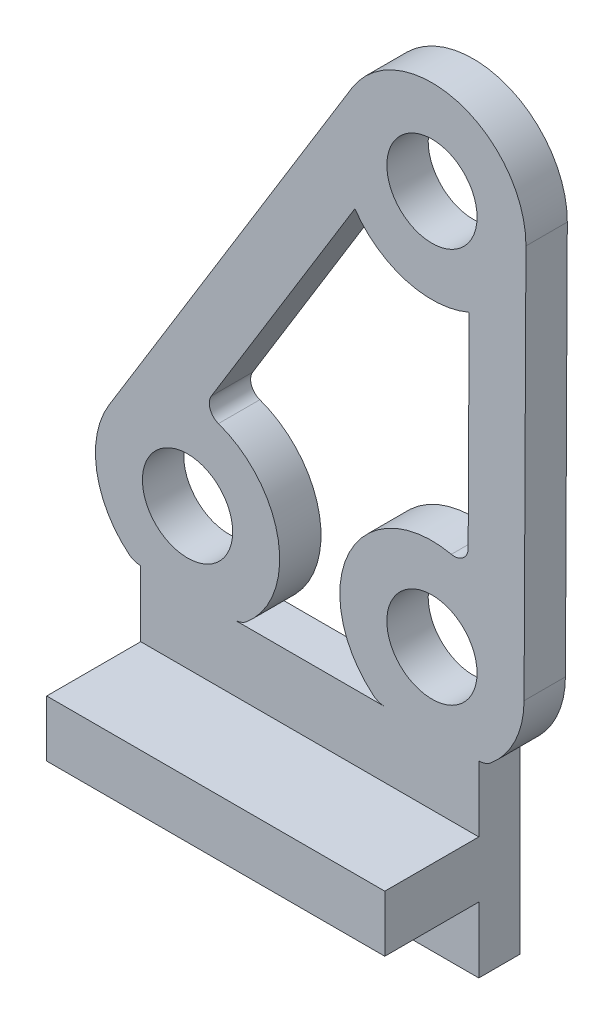
ISO-10303-21;
HEADER;
FILE_DESCRIPTION(('STEP AP214'),'2;1');
FILE_NAME('part.step','',(''),(''),'','','');
FILE_SCHEMA(('AUTOMOTIVE_DESIGN { 1 0 10303 214 1 1 1 1 }'));
ENDSEC;
DATA;
#1=APPLICATION_CONTEXT('core data for automotive mechanical design processes');
#2=APPLICATION_PROTOCOL_DEFINITION('international standard','automotive_design',2000,#1);
#3=PRODUCT_CONTEXT('',#1,'mechanical');
#4=PRODUCT('Part','Part','',(#3));
#5=PRODUCT_RELATED_PRODUCT_CATEGORY('part','',(#4));
#6=PRODUCT_DEFINITION_FORMATION('','',#4);
#7=PRODUCT_DEFINITION_CONTEXT('part definition',#1,'design');
#8=PRODUCT_DEFINITION('design','',#6,#7);
#9=PRODUCT_DEFINITION_SHAPE('','',#8);
#10=(LENGTH_UNIT() NAMED_UNIT(*) SI_UNIT(.MILLI.,.METRE.));
#11=(NAMED_UNIT(*) PLANE_ANGLE_UNIT() SI_UNIT($,.RADIAN.));
#12=(NAMED_UNIT(*) SI_UNIT($,.STERADIAN.) SOLID_ANGLE_UNIT());
#13=UNCERTAINTY_MEASURE_WITH_UNIT(LENGTH_MEASURE(1.E-05),#10,'distance_accuracy_value','');
#14=(GEOMETRIC_REPRESENTATION_CONTEXT(3) GLOBAL_UNCERTAINTY_ASSIGNED_CONTEXT((#13)) GLOBAL_UNIT_ASSIGNED_CONTEXT((#10,
#11,#12)) REPRESENTATION_CONTEXT('',''));
#15=CARTESIAN_POINT('',(0.,0.,0.));
#16=DIRECTION('',(0.,0.,1.));
#17=DIRECTION('',(1.,0.,0.));
#18=AXIS2_PLACEMENT_3D('',#15,#16,#17);
#19=CARTESIAN_POINT('',(0.,0.,8.));
#20=DIRECTION('',(0.,0.,1.));
#21=DIRECTION('',(1.,0.,0.));
#22=AXIS2_PLACEMENT_3D('',#19,#20,#21);
#23=PLANE('',#22);
#24=DIRECTION('',(-1.,0.,0.));
#25=VECTOR('',#24,1.);
#26=CARTESIAN_POINT('',(-1.24599357943771,-2.,8.));
#27=LINE('',#26,#25);
#28=CARTESIAN_POINT('',(5.25400642056229,-2.,8.));
#29=VERTEX_POINT('',#28);
#30=CARTESIAN_POINT('',(1.24599357943771,-2.,8.));
#31=VERTEX_POINT('',#30);
#32=EDGE_CURVE('E47',#29,#31,#27,.T.);
#33=ORIENTED_EDGE('',*,*,#32,.T.);
#34=CARTESIAN_POINT('',(1.24599357943771,-1.5,8.));
#35=DIRECTION('',(0.,0.,1.));
#36=DIRECTION('',(1.,0.,0.));
#37=AXIS2_PLACEMENT_3D('',#34,#35,#36);
#38=CIRCLE('',#37,0.500000000000002);
#39=CARTESIAN_POINT('',(1.56547911262687,-1.88461538461538,8.));
#40=VERTEX_POINT('',#39);
#41=EDGE_CURVE('E301',#31,#40,#38,.T.);
#42=ORIENTED_EDGE('',*,*,#41,.T.);
#43=CARTESIAN_POINT('',(0.,0.,8.));
#44=DIRECTION('',(0.,0.,1.));
#45=DIRECTION('',(1.,0.,0.));
#46=AXIS2_PLACEMENT_3D('',#43,#44,#45);
#47=CIRCLE('',#46,2.45);
#48=CARTESIAN_POINT('',(0.822306836927171,2.30788029714343,8.));
#49=VERTEX_POINT('',#48);
#50=EDGE_CURVE('E299',#40,#49,#47,.T.);
#51=ORIENTED_EDGE('',*,*,#50,.T.);
#52=CARTESIAN_POINT('',(0.945857287408487,2.65463607924849,8.));
#53=DIRECTION('',(0.,0.,1.));
#54=DIRECTION('',(1.,0.,0.));
#55=AXIS2_PLACEMENT_3D('',#52,#53,#54);
#56=CIRCLE('',#55,0.368109068398797);
#57=CARTESIAN_POINT('',(0.632085047138186,2.84712313718535,8.));
#58=VERTEX_POINT('',#57);
#59=EDGE_CURVE('E296',#58,#49,#56,.T.);
#60=ORIENTED_EDGE('',*,*,#59,.F.);
#61=DIRECTION('',(0.522907677265706,0.852389324813834,0.));
#62=VECTOR('',#61,1.);
#63=CARTESIAN_POINT('',(-0.809769858573143,0.496762293402421,8.));
#64=LINE('',#63,#62);
#65=CARTESIAN_POINT('',(4.44947866891435,9.06983837599987,8.));
#66=VERTEX_POINT('',#65);
#67=EDGE_CURVE('E294',#58,#66,#64,.T.);
#68=ORIENTED_EDGE('',*,*,#67,.T.);
#69=CARTESIAN_POINT('',(6.5,10.5,8.));
#70=DIRECTION('',(0.,0.,1.));
#71=DIRECTION('',(1.,0.,0.));
#72=AXIS2_PLACEMENT_3D('',#69,#70,#71);
#73=CIRCLE('',#72,2.5);
#74=CARTESIAN_POINT('',(7.48907776755545,8.20397622622773,8.));
#75=VERTEX_POINT('',#74);
#76=EDGE_CURVE('E292',#66,#75,#73,.T.);
#77=ORIENTED_EDGE('',*,*,#76,.T.);
#78=DIRECTION('',(0.00476190476190518,0.999988662067245,0.));
#79=VECTOR('',#78,1.);
#80=CARTESIAN_POINT('',(7.44984183667363,-0.0354758395401797,8.));
#81=LINE('',#80,#79);
#82=CARTESIAN_POINT('',(7.46311960749912,2.7528244198936,8.));
#83=VERTEX_POINT('',#82);
#84=EDGE_CURVE('E289',#83,#75,#81,.T.);
#85=ORIENTED_EDGE('',*,*,#84,.F.);
#86=CARTESIAN_POINT('',(7.09501471269619,2.75457732021931,8.));
#87=DIRECTION('',(0.,0.,1.));
#88=DIRECTION('',(1.,0.,0.));
#89=AXIS2_PLACEMENT_3D('',#86,#87,#88);
#90=CIRCLE('',#89,0.368109068398796);
#91=CARTESIAN_POINT('',(7.01729227319579,2.39476694149805,8.));
#92=VERTEX_POINT('',#91);
#93=EDGE_CURVE('E323',#92,#83,#90,.T.);
#94=ORIENTED_EDGE('',*,*,#93,.F.);
#95=CARTESIAN_POINT('',(6.5,0.,8.));
#96=DIRECTION('',(0.,0.,1.));
#97=DIRECTION('',(1.,0.,0.));
#98=AXIS2_PLACEMENT_3D('',#95,#96,#97);
#99=CIRCLE('',#98,2.45);
#100=CARTESIAN_POINT('',(4.93452088737313,-1.88461538461538,8.));
#101=VERTEX_POINT('',#100);
#102=EDGE_CURVE('E321',#92,#101,#99,.T.);
#103=ORIENTED_EDGE('',*,*,#102,.T.);
#104=CARTESIAN_POINT('',(5.25400642056229,-1.5,8.));
#105=DIRECTION('',(0.,0.,1.));
#106=DIRECTION('',(1.,0.,0.));
#107=AXIS2_PLACEMENT_3D('',#104,#105,#106);
#108=CIRCLE('',#107,0.500000000000002);
#109=EDGE_CURVE('E318',#101,#29,#108,.T.);
#110=ORIENTED_EDGE('',*,*,#109,.T.);
#111=EDGE_LOOP('',(#33,#42,#51,#60,#68,#77,#85,#94,#103,#110));
#112=FACE_BOUND('',#111,.T.);
#113=CARTESIAN_POINT('',(6.5,10.5,8.));
#114=DIRECTION('',(0.,0.,1.));
#115=DIRECTION('',(1.,0.,0.));
#116=AXIS2_PLACEMENT_3D('',#113,#114,#115);
#117=CIRCLE('',#116,1.2);
#118=CARTESIAN_POINT('',(7.7,10.5,8.));
#119=VERTEX_POINT('',#118);
#120=EDGE_CURVE('E377',#119,#119,#117,.T.);
#121=ORIENTED_EDGE('',*,*,#120,.F.);
#122=EDGE_LOOP('',(#121));
#123=FACE_BOUND('',#122,.T.);
#124=CARTESIAN_POINT('',(0.,0.,8.));
#125=DIRECTION('',(0.,0.,1.));
#126=DIRECTION('',(1.,0.,0.));
#127=AXIS2_PLACEMENT_3D('',#124,#125,#126);
#128=CIRCLE('',#127,1.2);
#129=CARTESIAN_POINT('',(1.2,0.,8.));
#130=VERTEX_POINT('',#129);
#131=EDGE_CURVE('E370',#130,#130,#128,.T.);
#132=ORIENTED_EDGE('',*,*,#131,.F.);
#133=EDGE_LOOP('',(#132));
#134=FACE_BOUND('',#133,.T.);
#135=CARTESIAN_POINT('',(6.5,0.,8.));
#136=DIRECTION('',(0.,0.,1.));
#137=DIRECTION('',(1.,0.,0.));
#138=AXIS2_PLACEMENT_3D('',#135,#136,#137);
#139=CIRCLE('',#138,1.2);
#140=CARTESIAN_POINT('',(7.7,0.,8.));
#141=VERTEX_POINT('',#140);
#142=EDGE_CURVE('E369',#141,#141,#139,.T.);
#143=ORIENTED_EDGE('',*,*,#142,.F.);
#144=EDGE_LOOP('',(#143));
#145=FACE_BOUND('',#144,.T.);
#146=DIRECTION('',(0.,1.,0.));
#147=VECTOR('',#146,1.);
#148=CARTESIAN_POINT('',(-1.24599357943771,-7.,8.));
#149=LINE('',#148,#147);
#150=CARTESIAN_POINT('',(-1.24599357943771,-3.75,8.));
#151=VERTEX_POINT('',#150);
#152=CARTESIAN_POINT('',(-1.24599357943771,-2.,8.));
#153=VERTEX_POINT('',#152);
#154=EDGE_CURVE('E60',#151,#153,#149,.T.);
#155=ORIENTED_EDGE('',*,*,#154,.F.);
#156=DIRECTION('',(1.,0.,0.));
#157=VECTOR('',#156,1.);
#158=CARTESIAN_POINT('',(-4.16146952686036,-3.75,8.));
#159=LINE('',#158,#157);
#160=CARTESIAN_POINT('',(7.74599357943771,-3.75,8.));
#161=VERTEX_POINT('',#160);
#162=EDGE_CURVE('E55',#151,#161,#159,.T.);
#163=ORIENTED_EDGE('',*,*,#162,.T.);
#164=DIRECTION('',(0.,1.,0.));
#165=VECTOR('',#164,1.);
#166=CARTESIAN_POINT('',(7.74599357943771,-7.,8.));
#167=LINE('',#166,#165);
#168=CARTESIAN_POINT('',(7.74599357943771,-2.,8.));
#169=VERTEX_POINT('',#168);
#170=EDGE_CURVE('E222',#161,#169,#167,.T.);
#171=ORIENTED_EDGE('',*,*,#170,.T.);
#172=CARTESIAN_POINT('',(7.74599357943771,-1.5,8.));
#173=DIRECTION('',(0.,0.,1.));
#174=DIRECTION('',(1.,0.,0.));
#175=AXIS2_PLACEMENT_3D('',#172,#173,#174);
#176=CIRCLE('',#175,0.500000000000002);
#177=CARTESIAN_POINT('',(8.06547911262686,-1.88461538461539,8.));
#178=VERTEX_POINT('',#177);
#179=EDGE_CURVE('E316',#169,#178,#176,.T.);
#180=ORIENTED_EDGE('',*,*,#179,.T.);
#181=CARTESIAN_POINT('',(6.5,0.,8.));
#182=DIRECTION('',(0.,0.,1.));
#183=DIRECTION('',(1.,0.,0.));
#184=AXIS2_PLACEMENT_3D('',#181,#182,#183);
#185=CIRCLE('',#184,2.45);
#186=CARTESIAN_POINT('',(8.94997222206475,-0.011666666666667,8.));
#187=VERTEX_POINT('',#186);
#188=EDGE_CURVE('E314',#178,#187,#185,.T.);
#189=ORIENTED_EDGE('',*,*,#188,.T.);
#190=DIRECTION('',(0.00476190476190494,0.999988662067245,0.));
#191=VECTOR('',#190,1.);
#192=CARTESIAN_POINT('',(8.9498248297745,-0.0426186966830353,8.));
#193=LINE('',#192,#191);
#194=CARTESIAN_POINT('',(8.99997165516811,10.4880952380953,8.));
#195=VERTEX_POINT('',#194);
#196=EDGE_CURVE('E312',#187,#195,#193,.T.);
#197=ORIENTED_EDGE('',*,*,#196,.T.);
#198=CARTESIAN_POINT('',(6.5,10.5,8.));
#199=DIRECTION('',(0.,0.,1.));
#200=DIRECTION('',(1.,0.,0.));
#201=AXIS2_PLACEMENT_3D('',#198,#199,#200);
#202=CIRCLE('',#201,2.5);
#203=CARTESIAN_POINT('',(4.36902668796541,11.8072691931643,8.));
#204=VERTEX_POINT('',#203);
#205=EDGE_CURVE('E310',#195,#204,#202,.T.);
#206=ORIENTED_EDGE('',*,*,#205,.T.);
#207=DIRECTION('',(0.522907677265706,0.852389324813834,0.));
#208=VECTOR('',#207,1.);
#209=CARTESIAN_POINT('',(-2.08835384579389,1.28112380930098,8.));
#210=LINE('',#209,#208);
#211=CARTESIAN_POINT('',(-2.08835384579389,1.28112380930098,8.));
#212=VERTEX_POINT('',#211);
#213=EDGE_CURVE('E307',#212,#204,#210,.T.);
#214=ORIENTED_EDGE('',*,*,#213,.F.);
#215=CARTESIAN_POINT('',(0.,0.,8.));
#216=DIRECTION('',(0.,0.,1.));
#217=DIRECTION('',(1.,0.,0.));
#218=AXIS2_PLACEMENT_3D('',#215,#216,#217);
#219=CIRCLE('',#218,2.45);
#220=CARTESIAN_POINT('',(-1.56547911262687,-1.88461538461538,8.));
#221=VERTEX_POINT('',#220);
#222=EDGE_CURVE('E305',#212,#221,#219,.T.);
#223=ORIENTED_EDGE('',*,*,#222,.T.);
#224=CARTESIAN_POINT('',(-1.24599357943771,-1.5,8.));
#225=DIRECTION('',(0.,0.,1.));
#226=DIRECTION('',(1.,0.,0.));
#227=AXIS2_PLACEMENT_3D('',#224,#225,#226);
#228=CIRCLE('',#227,0.500000000000002);
#229=EDGE_CURVE('E303',#221,#153,#228,.T.);
#230=ORIENTED_EDGE('',*,*,#229,.T.);
#231=EDGE_LOOP('',(#155,#163,#171,#180,#189,#197,#206,#214,#223,#230));
#232=FACE_BOUND('',#231,.T.);
#233=ADVANCED_FACE('F38',(#112,#123,#134,#145,#232),#23,.T.);
#234=CARTESIAN_POINT('',(4.28002964198449,8.7936203208159,6.9));
#235=DIRECTION('',(0.,0.,-1.));
#236=DIRECTION('',(-1.,0.,0.));
#237=AXIS2_PLACEMENT_3D('',#234,#235,#236);
#238=PLANE('',#237);
#239=DIRECTION('',(-0.522907677265706,-0.852389324813834,0.));
#240=VECTOR('',#239,1.);
#241=CARTESIAN_POINT('',(-2.08835384579389,1.28112380930098,6.9));
#242=LINE('',#241,#240);
#243=CARTESIAN_POINT('',(4.36902668796541,11.8072691931643,6.9));
#244=VERTEX_POINT('',#243);
#245=CARTESIAN_POINT('',(-2.08835384579389,1.28112380930098,6.9));
#246=VERTEX_POINT('',#245);
#247=EDGE_CURVE('E343',#244,#246,#242,.T.);
#248=ORIENTED_EDGE('',*,*,#247,.F.);
#249=CARTESIAN_POINT('',(6.5,10.5,6.9));
#250=DIRECTION('',(0.,0.,-1.));
#251=DIRECTION('',(-1.,0.,0.));
#252=AXIS2_PLACEMENT_3D('',#249,#250,#251);
#253=CIRCLE('',#252,2.5);
#254=CARTESIAN_POINT('',(8.99997165516811,10.4880952380953,6.9));
#255=VERTEX_POINT('',#254);
#256=EDGE_CURVE('E340',#244,#255,#253,.T.);
#257=ORIENTED_EDGE('',*,*,#256,.T.);
#258=DIRECTION('',(-0.00476190476190494,-0.999988662067245,0.));
#259=VECTOR('',#258,1.);
#260=CARTESIAN_POINT('',(8.9498248297745,-0.0426186966830353,6.9));
#261=LINE('',#260,#259);
#262=CARTESIAN_POINT('',(8.94997222206475,-0.011666666666667,6.9));
#263=VERTEX_POINT('',#262);
#264=EDGE_CURVE('E338',#255,#263,#261,.T.);
#265=ORIENTED_EDGE('',*,*,#264,.T.);
#266=CARTESIAN_POINT('',(6.5,0.,6.9));
#267=DIRECTION('',(0.,0.,-1.));
#268=DIRECTION('',(-1.,0.,0.));
#269=AXIS2_PLACEMENT_3D('',#266,#267,#268);
#270=CIRCLE('',#269,2.45);
#271=CARTESIAN_POINT('',(8.06547911262686,-1.88461538461539,6.9));
#272=VERTEX_POINT('',#271);
#273=EDGE_CURVE('E336',#263,#272,#270,.T.);
#274=ORIENTED_EDGE('',*,*,#273,.T.);
#275=CARTESIAN_POINT('',(7.74599357943771,-1.5,6.9));
#276=DIRECTION('',(0.,0.,-1.));
#277=DIRECTION('',(-1.,0.,0.));
#278=AXIS2_PLACEMENT_3D('',#275,#276,#277);
#279=CIRCLE('',#278,0.500000000000002);
#280=CARTESIAN_POINT('',(7.74599357943771,-2.,6.9));
#281=VERTEX_POINT('',#280);
#282=EDGE_CURVE('E333',#272,#281,#279,.T.);
#283=ORIENTED_EDGE('',*,*,#282,.T.);
#284=DIRECTION('',(0.,1.,0.));
#285=VECTOR('',#284,1.);
#286=CARTESIAN_POINT('',(7.74599357943771,-7.,6.9));
#287=LINE('',#286,#285);
#288=CARTESIAN_POINT('',(7.74599357943771,-7.,6.9));
#289=VERTEX_POINT('',#288);
#290=EDGE_CURVE('E385',#289,#281,#287,.T.);
#291=ORIENTED_EDGE('',*,*,#290,.F.);
#292=DIRECTION('',(1.,0.,0.));
#293=VECTOR('',#292,1.);
#294=CARTESIAN_POINT('',(-1.24599357943771,-7.,6.9));
#295=LINE('',#294,#293);
#296=CARTESIAN_POINT('',(-1.24599357943771,-7.,6.9));
#297=VERTEX_POINT('',#296);
#298=EDGE_CURVE('E396',#297,#289,#295,.T.);
#299=ORIENTED_EDGE('',*,*,#298,.F.);
#300=DIRECTION('',(0.,1.,0.));
#301=VECTOR('',#300,1.);
#302=CARTESIAN_POINT('',(-1.24599357943771,-7.,6.9));
#303=LINE('',#302,#301);
#304=CARTESIAN_POINT('',(-1.24599357943771,-2.,6.9));
#305=VERTEX_POINT('',#304);
#306=EDGE_CURVE('E373',#297,#305,#303,.T.);
#307=ORIENTED_EDGE('',*,*,#306,.T.);
#308=CARTESIAN_POINT('',(-1.24599357943771,-1.5,6.9));
#309=DIRECTION('',(0.,0.,-1.));
#310=DIRECTION('',(-1.,0.,0.));
#311=AXIS2_PLACEMENT_3D('',#308,#309,#310);
#312=CIRCLE('',#311,0.500000000000002);
#313=CARTESIAN_POINT('',(-1.56547911262687,-1.88461538461538,6.9));
#314=VERTEX_POINT('',#313);
#315=EDGE_CURVE('E348',#305,#314,#312,.T.);
#316=ORIENTED_EDGE('',*,*,#315,.T.);
#317=CARTESIAN_POINT('',(0.,0.,6.9));
#318=DIRECTION('',(0.,0.,-1.));
#319=DIRECTION('',(-1.,0.,0.));
#320=AXIS2_PLACEMENT_3D('',#317,#318,#319);
#321=CIRCLE('',#320,2.45);
#322=EDGE_CURVE('E345',#314,#246,#321,.T.);
#323=ORIENTED_EDGE('',*,*,#322,.T.);
#324=EDGE_LOOP('',(#248,#257,#265,#274,#283,#291,#299,#307,#316,#323));
#325=FACE_BOUND('',#324,.T.);
#326=CARTESIAN_POINT('',(6.5,10.5,6.9));
#327=DIRECTION('',(0.,0.,-1.));
#328=DIRECTION('',(-1.,0.,0.));
#329=AXIS2_PLACEMENT_3D('',#326,#327,#328);
#330=CIRCLE('',#329,2.5);
#331=CARTESIAN_POINT('',(7.48907776755545,8.20397622622773,6.9));
#332=VERTEX_POINT('',#331);
#333=CARTESIAN_POINT('',(4.44947866891435,9.06983837599987,6.9));
#334=VERTEX_POINT('',#333);
#335=EDGE_CURVE('E360',#332,#334,#330,.T.);
#336=ORIENTED_EDGE('',*,*,#335,.T.);
#337=DIRECTION('',(-0.522907677265706,-0.852389324813834,0.));
#338=VECTOR('',#337,1.);
#339=CARTESIAN_POINT('',(-0.809769858573143,0.496762293402421,6.9));
#340=LINE('',#339,#338);
#341=CARTESIAN_POINT('',(0.632085047138186,2.84712313718535,6.9));
#342=VERTEX_POINT('',#341);
#343=EDGE_CURVE('E358',#334,#342,#340,.T.);
#344=ORIENTED_EDGE('',*,*,#343,.T.);
#345=CARTESIAN_POINT('',(0.945857287408487,2.65463607924849,6.9));
#346=DIRECTION('',(0.,0.,-1.));
#347=DIRECTION('',(-1.,0.,0.));
#348=AXIS2_PLACEMENT_3D('',#345,#346,#347);
#349=CIRCLE('',#348,0.368109068398797);
#350=CARTESIAN_POINT('',(0.822306836927171,2.30788029714343,6.9));
#351=VERTEX_POINT('',#350);
#352=EDGE_CURVE('E355',#351,#342,#349,.T.);
#353=ORIENTED_EDGE('',*,*,#352,.F.);
#354=CARTESIAN_POINT('',(0.,0.,6.9));
#355=DIRECTION('',(0.,0.,-1.));
#356=DIRECTION('',(-1.,0.,0.));
#357=AXIS2_PLACEMENT_3D('',#354,#355,#356);
#358=CIRCLE('',#357,2.45);
#359=CARTESIAN_POINT('',(1.56547911262687,-1.88461538461538,6.9));
#360=VERTEX_POINT('',#359);
#361=EDGE_CURVE('E353',#351,#360,#358,.T.);
#362=ORIENTED_EDGE('',*,*,#361,.T.);
#363=CARTESIAN_POINT('',(1.24599357943771,-1.5,6.9));
#364=DIRECTION('',(0.,0.,-1.));
#365=DIRECTION('',(-1.,0.,0.));
#366=AXIS2_PLACEMENT_3D('',#363,#364,#365);
#367=CIRCLE('',#366,0.500000000000002);
#368=CARTESIAN_POINT('',(1.24599357943771,-2.,6.9));
#369=VERTEX_POINT('',#368);
#370=EDGE_CURVE('E350',#360,#369,#367,.T.);
#371=ORIENTED_EDGE('',*,*,#370,.T.);
#372=DIRECTION('',(1.,0.,0.));
#373=VECTOR('',#372,1.);
#374=CARTESIAN_POINT('',(-1.24599357943771,-2.,6.9));
#375=LINE('',#374,#373);
#376=CARTESIAN_POINT('',(5.25400642056229,-2.,6.9));
#377=VERTEX_POINT('',#376);
#378=EDGE_CURVE('E11',#369,#377,#375,.T.);
#379=ORIENTED_EDGE('',*,*,#378,.T.);
#380=CARTESIAN_POINT('',(5.25400642056229,-1.5,6.9));
#381=DIRECTION('',(0.,0.,-1.));
#382=DIRECTION('',(-1.,0.,0.));
#383=AXIS2_PLACEMENT_3D('',#380,#381,#382);
#384=CIRCLE('',#383,0.500000000000002);
#385=CARTESIAN_POINT('',(4.93452088737313,-1.88461538461538,6.9));
#386=VERTEX_POINT('',#385);
#387=EDGE_CURVE('E331',#377,#386,#384,.T.);
#388=ORIENTED_EDGE('',*,*,#387,.T.);
#389=CARTESIAN_POINT('',(6.5,0.,6.9));
#390=DIRECTION('',(0.,0.,-1.));
#391=DIRECTION('',(-1.,0.,0.));
#392=AXIS2_PLACEMENT_3D('',#389,#390,#391);
#393=CIRCLE('',#392,2.45);
#394=CARTESIAN_POINT('',(7.01729227319579,2.39476694149805,6.9));
#395=VERTEX_POINT('',#394);
#396=EDGE_CURVE('E329',#386,#395,#393,.T.);
#397=ORIENTED_EDGE('',*,*,#396,.T.);
#398=CARTESIAN_POINT('',(7.09501471269619,2.75457732021931,6.9));
#399=DIRECTION('',(0.,0.,-1.));
#400=DIRECTION('',(-1.,0.,0.));
#401=AXIS2_PLACEMENT_3D('',#398,#399,#400);
#402=CIRCLE('',#401,0.368109068398796);
#403=CARTESIAN_POINT('',(7.46311960749912,2.7528244198936,6.9));
#404=VERTEX_POINT('',#403);
#405=EDGE_CURVE('E326',#404,#395,#402,.T.);
#406=ORIENTED_EDGE('',*,*,#405,.F.);
#407=DIRECTION('',(-0.00476190476190518,-0.999988662067245,0.));
#408=VECTOR('',#407,1.);
#409=CARTESIAN_POINT('',(7.44984183667363,-0.0354758395401797,6.9));
#410=LINE('',#409,#408);
#411=EDGE_CURVE('E363',#332,#404,#410,.T.);
#412=ORIENTED_EDGE('',*,*,#411,.F.);
#413=EDGE_LOOP('',(#336,#344,#353,#362,#371,#379,#388,#397,#406,#412));
#414=FACE_BOUND('',#413,.T.);
#415=CARTESIAN_POINT('',(6.5,0.,6.9));
#416=DIRECTION('',(0.,0.,-1.));
#417=DIRECTION('',(-1.,0.,0.));
#418=AXIS2_PLACEMENT_3D('',#415,#416,#417);
#419=CIRCLE('',#418,1.2);
#420=CARTESIAN_POINT('',(5.3,0.,6.9));
#421=VERTEX_POINT('',#420);
#422=EDGE_CURVE('E366',#421,#421,#419,.F.);
#423=ORIENTED_EDGE('',*,*,#422,.T.);
#424=EDGE_LOOP('',(#423));
#425=FACE_BOUND('',#424,.T.);
#426=CARTESIAN_POINT('',(0.,0.,6.9));
#427=DIRECTION('',(0.,0.,-1.));
#428=DIRECTION('',(-1.,0.,0.));
#429=AXIS2_PLACEMENT_3D('',#426,#427,#428);
#430=CIRCLE('',#429,1.2);
#431=CARTESIAN_POINT('',(-1.2,0.,6.9));
#432=VERTEX_POINT('',#431);
#433=EDGE_CURVE('E374',#432,#432,#430,.F.);
#434=ORIENTED_EDGE('',*,*,#433,.T.);
#435=EDGE_LOOP('',(#434));
#436=FACE_BOUND('',#435,.T.);
#437=CARTESIAN_POINT('',(6.5,10.5,6.9));
#438=DIRECTION('',(0.,0.,-1.));
#439=DIRECTION('',(-1.,0.,0.));
#440=AXIS2_PLACEMENT_3D('',#437,#438,#439);
#441=CIRCLE('',#440,1.2);
#442=CARTESIAN_POINT('',(5.3,10.5,6.9));
#443=VERTEX_POINT('',#442);
#444=EDGE_CURVE('E365',#443,#443,#441,.F.);
#445=ORIENTED_EDGE('',*,*,#444,.T.);
#446=EDGE_LOOP('',(#445));
#447=FACE_BOUND('',#446,.T.);
#448=ADVANCED_FACE('F410',(#325,#414,#425,#436,#447),#238,.T.);
#449=CARTESIAN_POINT('',(-0.809769858573143,0.496762293402421,8.));
#450=DIRECTION('',(-0.852389324813834,0.522907677265706,0.));
#451=DIRECTION('',(-0.522907677265706,-0.852389324813834,0.));
#452=AXIS2_PLACEMENT_3D('',#449,#450,#451);
#453=PLANE('',#452);
#454=ORIENTED_EDGE('',*,*,#343,.F.);
#455=DIRECTION('',(0.,0.,-1.));
#456=VECTOR('',#455,1.);
#457=CARTESIAN_POINT('',(4.44947866891435,9.06983837599987,8.));
#458=LINE('',#457,#456);
#459=EDGE_CURVE('E280',#66,#334,#458,.T.);
#460=ORIENTED_EDGE('',*,*,#459,.F.);
#461=ORIENTED_EDGE('',*,*,#67,.F.);
#462=DIRECTION('',(0.,0.,-1.));
#463=VECTOR('',#462,1.);
#464=CARTESIAN_POINT('',(0.632085047138186,2.84712313718535,8.));
#465=LINE('',#464,#463);
#466=EDGE_CURVE('E277',#58,#342,#465,.T.);
#467=ORIENTED_EDGE('',*,*,#466,.T.);
#468=EDGE_LOOP('',(#454,#460,#461,#467));
#469=FACE_BOUND('',#468,.T.);
#470=ADVANCED_FACE('F462',(#469),#453,.F.);
#471=CARTESIAN_POINT('',(0.945857287408487,2.65463607924849,8.));
#472=DIRECTION('',(0.,0.,-1.));
#473=DIRECTION('',(-1.,0.,0.));
#474=AXIS2_PLACEMENT_3D('',#471,#472,#473);
#475=CYLINDRICAL_SURFACE('',#474,0.368109068398797);
#476=DIRECTION('',(0.,0.,-1.));
#477=VECTOR('',#476,1.);
#478=CARTESIAN_POINT('',(0.822306836927171,2.30788029714343,8.));
#479=LINE('',#478,#477);
#480=EDGE_CURVE('E274',#49,#351,#479,.T.);
#481=ORIENTED_EDGE('',*,*,#480,.T.);
#482=ORIENTED_EDGE('',*,*,#352,.T.);
#483=ORIENTED_EDGE('',*,*,#466,.F.);
#484=ORIENTED_EDGE('',*,*,#59,.T.);
#485=EDGE_LOOP('',(#481,#482,#483,#484));
#486=FACE_BOUND('',#485,.T.);
#487=ADVANCED_FACE('F472',(#486),#475,.F.);
#488=CARTESIAN_POINT('',(0.,0.,8.));
#489=DIRECTION('',(0.,0.,-1.));
#490=DIRECTION('',(-1.,0.,0.));
#491=AXIS2_PLACEMENT_3D('',#488,#489,#490);
#492=CYLINDRICAL_SURFACE('',#491,2.45);
#493=ORIENTED_EDGE('',*,*,#361,.F.);
#494=ORIENTED_EDGE('',*,*,#480,.F.);
#495=ORIENTED_EDGE('',*,*,#50,.F.);
#496=DIRECTION('',(0.,0.,-1.));
#497=VECTOR('',#496,1.);
#498=CARTESIAN_POINT('',(1.56547911262687,-1.88461538461538,8.));
#499=LINE('',#498,#497);
#500=EDGE_CURVE('E271',#40,#360,#499,.T.);
#501=ORIENTED_EDGE('',*,*,#500,.T.);
#502=EDGE_LOOP('',(#493,#494,#495,#501));
#503=FACE_BOUND('',#502,.T.);
#504=ADVANCED_FACE('F477',(#503),#492,.T.);
#505=CARTESIAN_POINT('',(-2.08835384579389,1.28112380930098,8.));
#506=DIRECTION('',(-0.852389324813834,0.522907677265706,0.));
#507=DIRECTION('',(-0.522907677265706,-0.852389324813834,0.));
#508=AXIS2_PLACEMENT_3D('',#505,#506,#507);
#509=PLANE('',#508);
#510=DIRECTION('',(0.,0.,-1.));
#511=VECTOR('',#510,1.);
#512=CARTESIAN_POINT('',(4.36902668796541,11.8072691931643,8.));
#513=LINE('',#512,#511);
#514=EDGE_CURVE('E256',#204,#244,#513,.T.);
#515=ORIENTED_EDGE('',*,*,#514,.T.);
#516=ORIENTED_EDGE('',*,*,#247,.T.);
#517=DIRECTION('',(0.,0.,-1.));
#518=VECTOR('',#517,1.);
#519=CARTESIAN_POINT('',(-2.08835384579389,1.28112380930098,8.));
#520=LINE('',#519,#518);
#521=EDGE_CURVE('E259',#212,#246,#520,.T.);
#522=ORIENTED_EDGE('',*,*,#521,.F.);
#523=ORIENTED_EDGE('',*,*,#213,.T.);
#524=EDGE_LOOP('',(#515,#516,#522,#523));
#525=FACE_BOUND('',#524,.T.);
#526=ADVANCED_FACE('F436',(#525),#509,.T.);
#527=CARTESIAN_POINT('',(8.9498248297745,-0.0426186966830353,8.));
#528=DIRECTION('',(-0.999988662067245,0.00476190476190494,0.));
#529=DIRECTION('',(-0.00476190476190494,-0.999988662067245,0.));
#530=AXIS2_PLACEMENT_3D('',#527,#528,#529);
#531=PLANE('',#530);
#532=ORIENTED_EDGE('',*,*,#264,.F.);
#533=DIRECTION('',(0.,0.,-1.));
#534=VECTOR('',#533,1.);
#535=CARTESIAN_POINT('',(8.99997165516811,10.4880952380953,8.));
#536=LINE('',#535,#534);
#537=EDGE_CURVE('E253',#195,#255,#536,.T.);
#538=ORIENTED_EDGE('',*,*,#537,.F.);
#539=ORIENTED_EDGE('',*,*,#196,.F.);
#540=DIRECTION('',(0.,0.,-1.));
#541=VECTOR('',#540,1.);
#542=CARTESIAN_POINT('',(8.94997222206475,-0.011666666666667,8.));
#543=LINE('',#542,#541);
#544=EDGE_CURVE('E250',#187,#263,#543,.T.);
#545=ORIENTED_EDGE('',*,*,#544,.T.);
#546=EDGE_LOOP('',(#532,#538,#539,#545));
#547=FACE_BOUND('',#546,.T.);
#548=ADVANCED_FACE('F441',(#547),#531,.F.);
#549=CARTESIAN_POINT('',(6.5,0.,8.));
#550=DIRECTION('',(0.,0.,-1.));
#551=DIRECTION('',(-1.,0.,0.));
#552=AXIS2_PLACEMENT_3D('',#549,#550,#551);
#553=CYLINDRICAL_SURFACE('',#552,2.45);
#554=ORIENTED_EDGE('',*,*,#273,.F.);
#555=ORIENTED_EDGE('',*,*,#544,.F.);
#556=ORIENTED_EDGE('',*,*,#188,.F.);
#557=DIRECTION('',(0.,0.,-1.));
#558=VECTOR('',#557,1.);
#559=CARTESIAN_POINT('',(8.06547911262686,-1.88461538461539,8.));
#560=LINE('',#559,#558);
#561=EDGE_CURVE('E247',#178,#272,#560,.T.);
#562=ORIENTED_EDGE('',*,*,#561,.T.);
#563=EDGE_LOOP('',(#554,#555,#556,#562));
#564=FACE_BOUND('',#563,.T.);
#565=ADVANCED_FACE('F444',(#564),#553,.T.);
#566=CARTESIAN_POINT('',(5.25400642056229,-1.5,8.));
#567=DIRECTION('',(0.,0.,-1.));
#568=DIRECTION('',(-1.,0.,0.));
#569=AXIS2_PLACEMENT_3D('',#566,#567,#568);
#570=CYLINDRICAL_SURFACE('',#569,0.500000000000002);
#571=ORIENTED_EDGE('',*,*,#387,.F.);
#572=DIRECTION('',(0.,0.,-1.));
#573=VECTOR('',#572,1.);
#574=CARTESIAN_POINT('',(5.25400642056229,-2.,8.));
#575=LINE('',#574,#573);
#576=EDGE_CURVE('E242',#29,#377,#575,.T.);
#577=ORIENTED_EDGE('',*,*,#576,.F.);
#578=ORIENTED_EDGE('',*,*,#109,.F.);
#579=DIRECTION('',(0.,0.,-1.));
#580=VECTOR('',#579,1.);
#581=CARTESIAN_POINT('',(4.93452088737313,-1.88461538461538,8.));
#582=LINE('',#581,#580);
#583=EDGE_CURVE('E239',#101,#386,#582,.T.);
#584=ORIENTED_EDGE('',*,*,#583,.T.);
#585=EDGE_LOOP('',(#571,#577,#578,#584));
#586=FACE_BOUND('',#585,.T.);
#587=ADVANCED_FACE('F456',(#586),#570,.T.);
#588=CARTESIAN_POINT('',(-1.24599357943771,-1.5,8.));
#589=DIRECTION('',(0.,0.,-1.));
#590=DIRECTION('',(-1.,0.,0.));
#591=AXIS2_PLACEMENT_3D('',#588,#589,#590);
#592=CYLINDRICAL_SURFACE('',#591,0.500000000000002);
#593=ORIENTED_EDGE('',*,*,#315,.F.);
#594=DIRECTION('',(0.,0.,-1.));
#595=VECTOR('',#594,1.);
#596=CARTESIAN_POINT('',(-1.24599357943771,-2.,8.));
#597=LINE('',#596,#595);
#598=EDGE_CURVE('E265',#153,#305,#597,.T.);
#599=ORIENTED_EDGE('',*,*,#598,.F.);
#600=ORIENTED_EDGE('',*,*,#229,.F.);
#601=DIRECTION('',(0.,0.,-1.));
#602=VECTOR('',#601,1.);
#603=CARTESIAN_POINT('',(-1.56547911262687,-1.88461538461538,8.));
#604=LINE('',#603,#602);
#605=EDGE_CURVE('E262',#221,#314,#604,.T.);
#606=ORIENTED_EDGE('',*,*,#605,.T.);
#607=EDGE_LOOP('',(#593,#599,#600,#606));
#608=FACE_BOUND('',#607,.T.);
#609=ADVANCED_FACE('F426',(#608),#592,.T.);
#610=CARTESIAN_POINT('',(7.74599357943771,-1.5,8.));
#611=DIRECTION('',(0.,0.,-1.));
#612=DIRECTION('',(-1.,0.,0.));
#613=AXIS2_PLACEMENT_3D('',#610,#611,#612);
#614=CYLINDRICAL_SURFACE('',#613,0.500000000000002);
#615=ORIENTED_EDGE('',*,*,#282,.F.);
#616=ORIENTED_EDGE('',*,*,#561,.F.);
#617=ORIENTED_EDGE('',*,*,#179,.F.);
#618=DIRECTION('',(0.,0.,-1.));
#619=VECTOR('',#618,1.);
#620=CARTESIAN_POINT('',(7.74599357943771,-2.,8.));
#621=LINE('',#620,#619);
#622=EDGE_CURVE('E244',#169,#281,#621,.T.);
#623=ORIENTED_EDGE('',*,*,#622,.T.);
#624=EDGE_LOOP('',(#615,#616,#617,#623));
#625=FACE_BOUND('',#624,.T.);
#626=ADVANCED_FACE('F448',(#625),#614,.T.);
#627=DIRECTION('',(1.,0.,0.));
#628=VECTOR('',#627,1.);
#629=CARTESIAN_POINT('',(-4.16146952686036,-5.25,8.));
#630=LINE('',#629,#628);
#631=CARTESIAN_POINT('',(-1.24599357943771,-5.25,8.));
#632=VERTEX_POINT('',#631);
#633=CARTESIAN_POINT('',(7.74599357943771,-5.25,8.));
#634=VERTEX_POINT('',#633);
#635=EDGE_CURVE('E229',#632,#634,#630,.T.);
#636=ORIENTED_EDGE('',*,*,#635,.F.);
#637=CARTESIAN_POINT('',(-1.24599357943771,-7.,8.));
#638=VERTEX_POINT('',#637);
#639=EDGE_CURVE('E389',#638,#632,#149,.T.);
#640=ORIENTED_EDGE('',*,*,#639,.F.);
#641=DIRECTION('',(-1.,0.,0.));
#642=VECTOR('',#641,1.);
#643=CARTESIAN_POINT('',(-1.24599357943771,-7.,8.));
#644=LINE('',#643,#642);
#645=CARTESIAN_POINT('',(7.74599357943771,-7.,8.));
#646=VERTEX_POINT('',#645);
#647=EDGE_CURVE('E392',#646,#638,#644,.T.);
#648=ORIENTED_EDGE('',*,*,#647,.F.);
#649=EDGE_CURVE('E387',#646,#634,#167,.T.);
#650=ORIENTED_EDGE('',*,*,#649,.T.);
#651=EDGE_LOOP('',(#636,#640,#648,#650));
#652=FACE_BOUND('',#651,.T.);
#653=ADVANCED_FACE('F417',(#652),#23,.T.);
#654=CARTESIAN_POINT('',(7.74599357943771,-7.,8.));
#655=DIRECTION('',(-1.,0.,0.));
#656=DIRECTION('',(0.,0.,1.));
#657=AXIS2_PLACEMENT_3D('',#654,#655,#656);
#658=PLANE('',#657);
#659=ORIENTED_EDGE('',*,*,#622,.F.);
#660=ORIENTED_EDGE('',*,*,#170,.F.);
#661=DIRECTION('',(0.,0.,1.));
#662=VECTOR('',#661,1.);
#663=CARTESIAN_POINT('',(7.74599357943771,-3.75,8.));
#664=LINE('',#663,#662);
#665=CARTESIAN_POINT('',(7.74599357943771,-3.75,10.5));
#666=VERTEX_POINT('',#665);
#667=EDGE_CURVE('E205',#161,#666,#664,.T.);
#668=ORIENTED_EDGE('',*,*,#667,.T.);
#669=DIRECTION('',(0.,-1.,0.));
#670=VECTOR('',#669,1.);
#671=CARTESIAN_POINT('',(7.74599357943771,-3.75,10.5));
#672=LINE('',#671,#670);
#673=CARTESIAN_POINT('',(7.74599357943771,-5.25,10.5));
#674=VERTEX_POINT('',#673);
#675=EDGE_CURVE('E212',#666,#674,#672,.T.);
#676=ORIENTED_EDGE('',*,*,#675,.T.);
#677=DIRECTION('',(0.,0.,-1.));
#678=VECTOR('',#677,1.);
#679=CARTESIAN_POINT('',(7.74599357943771,-5.25,8.));
#680=LINE('',#679,#678);
#681=EDGE_CURVE('E218',#674,#634,#680,.T.);
#682=ORIENTED_EDGE('',*,*,#681,.T.);
#683=ORIENTED_EDGE('',*,*,#649,.F.);
#684=DIRECTION('',(0.,0.,1.));
#685=VECTOR('',#684,1.);
#686=CARTESIAN_POINT('',(7.74599357943771,-7.,8.));
#687=LINE('',#686,#685);
#688=EDGE_CURVE('E395',#289,#646,#687,.T.);
#689=ORIENTED_EDGE('',*,*,#688,.F.);
#690=ORIENTED_EDGE('',*,*,#290,.T.);
#691=EDGE_LOOP('',(#659,#660,#668,#676,#682,#683,#689,#690));
#692=FACE_BOUND('',#691,.T.);
#693=ADVANCED_FACE('F221',(#692),#658,.F.);
#694=CARTESIAN_POINT('',(-1.24599357943771,-7.,8.));
#695=DIRECTION('',(1.,0.,0.));
#696=DIRECTION('',(0.,0.,-1.));
#697=AXIS2_PLACEMENT_3D('',#694,#695,#696);
#698=PLANE('',#697);
#699=ORIENTED_EDGE('',*,*,#598,.T.);
#700=ORIENTED_EDGE('',*,*,#306,.F.);
#701=DIRECTION('',(0.,0.,-1.));
#702=VECTOR('',#701,1.);
#703=CARTESIAN_POINT('',(-1.24599357943771,-7.,8.));
#704=LINE('',#703,#702);
#705=EDGE_CURVE('E42',#638,#297,#704,.T.);
#706=ORIENTED_EDGE('',*,*,#705,.F.);
#707=ORIENTED_EDGE('',*,*,#639,.T.);
#708=DIRECTION('',(0.,0.,1.));
#709=VECTOR('',#708,1.);
#710=CARTESIAN_POINT('',(-1.24599357943771,-5.25,8.));
#711=LINE('',#710,#709);
#712=CARTESIAN_POINT('',(-1.24599357943771,-5.25,10.5));
#713=VERTEX_POINT('',#712);
#714=EDGE_CURVE('E225',#632,#713,#711,.T.);
#715=ORIENTED_EDGE('',*,*,#714,.T.);
#716=DIRECTION('',(0.,1.,0.));
#717=VECTOR('',#716,1.);
#718=CARTESIAN_POINT('',(-1.24599357943771,-3.75,10.5));
#719=LINE('',#718,#717);
#720=CARTESIAN_POINT('',(-1.24599357943771,-3.75,10.5));
#721=VERTEX_POINT('',#720);
#722=EDGE_CURVE('E232',#713,#721,#719,.T.);
#723=ORIENTED_EDGE('',*,*,#722,.T.);
#724=DIRECTION('',(0.,0.,-1.));
#725=VECTOR('',#724,1.);
#726=CARTESIAN_POINT('',(-1.24599357943771,-3.75,8.));
#727=LINE('',#726,#725);
#728=EDGE_CURVE('E206',#721,#151,#727,.T.);
#729=ORIENTED_EDGE('',*,*,#728,.T.);
#730=ORIENTED_EDGE('',*,*,#154,.T.);
#731=EDGE_LOOP('',(#699,#700,#706,#707,#715,#723,#729,#730));
#732=FACE_BOUND('',#731,.T.);
#733=ADVANCED_FACE('F406',(#732),#698,.F.);
#734=CARTESIAN_POINT('',(0.,-7.,0.));
#735=DIRECTION('',(0.,-1.,0.));
#736=DIRECTION('',(0.,0.,-1.));
#737=AXIS2_PLACEMENT_3D('',#734,#735,#736);
#738=PLANE('',#737);
#739=ORIENTED_EDGE('',*,*,#705,.T.);
#740=ORIENTED_EDGE('',*,*,#298,.T.);
#741=ORIENTED_EDGE('',*,*,#688,.T.);
#742=ORIENTED_EDGE('',*,*,#647,.T.);
#743=EDGE_LOOP('',(#739,#740,#741,#742));
#744=FACE_BOUND('',#743,.T.);
#745=ADVANCED_FACE('F402',(#744),#738,.T.);
#746=CARTESIAN_POINT('',(1.24599357943771,-1.5,8.));
#747=DIRECTION('',(0.,0.,-1.));
#748=DIRECTION('',(-1.,0.,0.));
#749=AXIS2_PLACEMENT_3D('',#746,#747,#748);
#750=CYLINDRICAL_SURFACE('',#749,0.500000000000002);
#751=ORIENTED_EDGE('',*,*,#370,.F.);
#752=ORIENTED_EDGE('',*,*,#500,.F.);
#753=ORIENTED_EDGE('',*,*,#41,.F.);
#754=DIRECTION('',(0.,0.,-1.));
#755=VECTOR('',#754,1.);
#756=CARTESIAN_POINT('',(1.24599357943771,-2.,8.));
#757=LINE('',#756,#755);
#758=EDGE_CURVE('E268',#31,#369,#757,.T.);
#759=ORIENTED_EDGE('',*,*,#758,.T.);
#760=EDGE_LOOP('',(#751,#752,#753,#759));
#761=FACE_BOUND('',#760,.T.);
#762=ADVANCED_FACE('F487',(#761),#750,.T.);
#763=CARTESIAN_POINT('',(0.,-2.,0.));
#764=DIRECTION('',(0.,-1.,0.));
#765=DIRECTION('',(0.,0.,-1.));
#766=AXIS2_PLACEMENT_3D('',#763,#764,#765);
#767=PLANE('',#766);
#768=ORIENTED_EDGE('',*,*,#758,.F.);
#769=ORIENTED_EDGE('',*,*,#32,.F.);
#770=ORIENTED_EDGE('',*,*,#576,.T.);
#771=ORIENTED_EDGE('',*,*,#378,.F.);
#772=EDGE_LOOP('',(#768,#769,#770,#771));
#773=FACE_BOUND('',#772,.T.);
#774=ADVANCED_FACE('F488',(#773),#767,.F.);
#775=CARTESIAN_POINT('',(6.5,10.5,3.50588745030457));
#776=DIRECTION('',(0.,0.,1.));
#777=DIRECTION('',(1.,0.,0.));
#778=AXIS2_PLACEMENT_3D('',#775,#776,#777);
#779=CYLINDRICAL_SURFACE('',#778,1.2);
#780=ORIENTED_EDGE('',*,*,#120,.T.);
#781=EDGE_LOOP('',(#780));
#782=FACE_BOUND('',#781,.T.);
#783=ORIENTED_EDGE('',*,*,#444,.F.);
#784=EDGE_LOOP('',(#783));
#785=FACE_BOUND('',#784,.T.);
#786=ADVANCED_FACE('F491',(#782,#785),#779,.F.);
#787=CARTESIAN_POINT('',(0.,0.,3.50588745030457));
#788=DIRECTION('',(0.,0.,1.));
#789=DIRECTION('',(1.,0.,0.));
#790=AXIS2_PLACEMENT_3D('',#787,#788,#789);
#791=CYLINDRICAL_SURFACE('',#790,1.2);
#792=ORIENTED_EDGE('',*,*,#131,.T.);
#793=EDGE_LOOP('',(#792));
#794=FACE_BOUND('',#793,.T.);
#795=ORIENTED_EDGE('',*,*,#433,.F.);
#796=EDGE_LOOP('',(#795));
#797=FACE_BOUND('',#796,.T.);
#798=ADVANCED_FACE('F499',(#794,#797),#791,.F.);
#799=CARTESIAN_POINT('',(6.5,0.,3.50588745030457));
#800=DIRECTION('',(0.,0.,1.));
#801=DIRECTION('',(1.,0.,0.));
#802=AXIS2_PLACEMENT_3D('',#799,#800,#801);
#803=CYLINDRICAL_SURFACE('',#802,1.2);
#804=ORIENTED_EDGE('',*,*,#142,.T.);
#805=EDGE_LOOP('',(#804));
#806=FACE_BOUND('',#805,.T.);
#807=ORIENTED_EDGE('',*,*,#422,.F.);
#808=EDGE_LOOP('',(#807));
#809=FACE_BOUND('',#808,.T.);
#810=ADVANCED_FACE('F502',(#806,#809),#803,.F.);
#811=CARTESIAN_POINT('',(6.5,0.,8.));
#812=DIRECTION('',(0.,0.,-1.));
#813=DIRECTION('',(-1.,0.,0.));
#814=AXIS2_PLACEMENT_3D('',#811,#812,#813);
#815=CYLINDRICAL_SURFACE('',#814,2.45);
#816=ORIENTED_EDGE('',*,*,#396,.F.);
#817=ORIENTED_EDGE('',*,*,#583,.F.);
#818=ORIENTED_EDGE('',*,*,#102,.F.);
#819=DIRECTION('',(0.,0.,-1.));
#820=VECTOR('',#819,1.);
#821=CARTESIAN_POINT('',(7.01729227319579,2.39476694149805,8.));
#822=LINE('',#821,#820);
#823=EDGE_CURVE('E236',#92,#395,#822,.T.);
#824=ORIENTED_EDGE('',*,*,#823,.T.);
#825=EDGE_LOOP('',(#816,#817,#818,#824));
#826=FACE_BOUND('',#825,.T.);
#827=ADVANCED_FACE('F505',(#826),#815,.T.);
#828=CARTESIAN_POINT('',(7.44984183667363,-0.0354758395401797,8.));
#829=DIRECTION('',(-0.999988662067245,0.00476190476190518,0.));
#830=DIRECTION('',(-0.00476190476190518,-0.999988662067245,0.));
#831=AXIS2_PLACEMENT_3D('',#828,#829,#830);
#832=PLANE('',#831);
#833=DIRECTION('',(0.,0.,-1.));
#834=VECTOR('',#833,1.);
#835=CARTESIAN_POINT('',(7.48907776755545,8.20397622622773,8.));
#836=LINE('',#835,#834);
#837=EDGE_CURVE('E283',#75,#332,#836,.T.);
#838=ORIENTED_EDGE('',*,*,#837,.T.);
#839=ORIENTED_EDGE('',*,*,#411,.T.);
#840=DIRECTION('',(0.,0.,-1.));
#841=VECTOR('',#840,1.);
#842=CARTESIAN_POINT('',(7.46311960749912,2.7528244198936,8.));
#843=LINE('',#842,#841);
#844=EDGE_CURVE('E286',#83,#404,#843,.T.);
#845=ORIENTED_EDGE('',*,*,#844,.F.);
#846=ORIENTED_EDGE('',*,*,#84,.T.);
#847=EDGE_LOOP('',(#838,#839,#845,#846));
#848=FACE_BOUND('',#847,.T.);
#849=ADVANCED_FACE('F40',(#848),#832,.T.);
#850=CARTESIAN_POINT('',(7.09501471269619,2.75457732021931,8.));
#851=DIRECTION('',(0.,0.,-1.));
#852=DIRECTION('',(-1.,0.,0.));
#853=AXIS2_PLACEMENT_3D('',#850,#851,#852);
#854=CYLINDRICAL_SURFACE('',#853,0.368109068398796);
#855=ORIENTED_EDGE('',*,*,#844,.T.);
#856=ORIENTED_EDGE('',*,*,#405,.T.);
#857=ORIENTED_EDGE('',*,*,#823,.F.);
#858=ORIENTED_EDGE('',*,*,#93,.T.);
#859=EDGE_LOOP('',(#855,#856,#857,#858));
#860=FACE_BOUND('',#859,.T.);
#861=ADVANCED_FACE('F526',(#860),#854,.F.);
#862=CARTESIAN_POINT('',(6.5,10.5,8.));
#863=DIRECTION('',(0.,0.,-1.));
#864=DIRECTION('',(-1.,0.,0.));
#865=AXIS2_PLACEMENT_3D('',#862,#863,#864);
#866=CYLINDRICAL_SURFACE('',#865,2.5);
#867=ORIENTED_EDGE('',*,*,#537,.T.);
#868=ORIENTED_EDGE('',*,*,#256,.F.);
#869=ORIENTED_EDGE('',*,*,#514,.F.);
#870=ORIENTED_EDGE('',*,*,#205,.F.);
#871=EDGE_LOOP('',(#867,#868,#869,#870));
#872=FACE_BOUND('',#871,.T.);
#873=ADVANCED_FACE('F433',(#872),#866,.T.);
#874=CARTESIAN_POINT('',(0.,0.,8.));
#875=DIRECTION('',(0.,0.,-1.));
#876=DIRECTION('',(-1.,0.,0.));
#877=AXIS2_PLACEMENT_3D('',#874,#875,#876);
#878=CYLINDRICAL_SURFACE('',#877,2.45);
#879=ORIENTED_EDGE('',*,*,#322,.F.);
#880=ORIENTED_EDGE('',*,*,#605,.F.);
#881=ORIENTED_EDGE('',*,*,#222,.F.);
#882=ORIENTED_EDGE('',*,*,#521,.T.);
#883=EDGE_LOOP('',(#879,#880,#881,#882));
#884=FACE_BOUND('',#883,.T.);
#885=ADVANCED_FACE('F428',(#884),#878,.T.);
#886=CARTESIAN_POINT('',(6.5,10.5,8.));
#887=DIRECTION('',(0.,0.,-1.));
#888=DIRECTION('',(-1.,0.,0.));
#889=AXIS2_PLACEMENT_3D('',#886,#887,#888);
#890=CYLINDRICAL_SURFACE('',#889,2.5);
#891=ORIENTED_EDGE('',*,*,#335,.F.);
#892=ORIENTED_EDGE('',*,*,#837,.F.);
#893=ORIENTED_EDGE('',*,*,#76,.F.);
#894=ORIENTED_EDGE('',*,*,#459,.T.);
#895=EDGE_LOOP('',(#891,#892,#893,#894));
#896=FACE_BOUND('',#895,.T.);
#897=ADVANCED_FACE('F467',(#896),#890,.T.);
#898=CARTESIAN_POINT('',(-4.16146952686036,-5.25,8.));
#899=DIRECTION('',(0.,-1.,0.));
#900=DIRECTION('',(0.,0.,-1.));
#901=AXIS2_PLACEMENT_3D('',#898,#899,#900);
#902=PLANE('',#901);
#903=ORIENTED_EDGE('',*,*,#714,.F.);
#904=ORIENTED_EDGE('',*,*,#635,.T.);
#905=ORIENTED_EDGE('',*,*,#681,.F.);
#906=DIRECTION('',(1.,0.,0.));
#907=VECTOR('',#906,1.);
#908=CARTESIAN_POINT('',(-4.16146952686036,-5.25,10.5));
#909=LINE('',#908,#907);
#910=EDGE_CURVE('E209',#713,#674,#909,.T.);
#911=ORIENTED_EDGE('',*,*,#910,.F.);
#912=EDGE_LOOP('',(#903,#904,#905,#911));
#913=FACE_BOUND('',#912,.T.);
#914=ADVANCED_FACE('F420',(#913),#902,.T.);
#915=CARTESIAN_POINT('',(-4.16146952686036,-3.75,10.5));
#916=DIRECTION('',(0.,0.,1.));
#917=DIRECTION('',(1.,0.,0.));
#918=AXIS2_PLACEMENT_3D('',#915,#916,#917);
#919=PLANE('',#918);
#920=ORIENTED_EDGE('',*,*,#722,.F.);
#921=ORIENTED_EDGE('',*,*,#910,.T.);
#922=ORIENTED_EDGE('',*,*,#675,.F.);
#923=DIRECTION('',(1.,0.,0.));
#924=VECTOR('',#923,1.);
#925=CARTESIAN_POINT('',(-4.16146952686036,-3.75,10.5));
#926=LINE('',#925,#924);
#927=EDGE_CURVE('E201',#721,#666,#926,.T.);
#928=ORIENTED_EDGE('',*,*,#927,.F.);
#929=EDGE_LOOP('',(#920,#921,#922,#928));
#930=FACE_BOUND('',#929,.T.);
#931=ADVANCED_FACE('F213',(#930),#919,.T.);
#932=CARTESIAN_POINT('',(-4.16146952686036,-3.75,8.));
#933=DIRECTION('',(0.,1.,0.));
#934=DIRECTION('',(0.,0.,1.));
#935=AXIS2_PLACEMENT_3D('',#932,#933,#934);
#936=PLANE('',#935);
#937=ORIENTED_EDGE('',*,*,#728,.F.);
#938=ORIENTED_EDGE('',*,*,#927,.T.);
#939=ORIENTED_EDGE('',*,*,#667,.F.);
#940=ORIENTED_EDGE('',*,*,#162,.F.);
#941=EDGE_LOOP('',(#937,#938,#939,#940));
#942=FACE_BOUND('',#941,.T.);
#943=ADVANCED_FACE('F203',(#942),#936,.T.);
#944=CLOSED_SHELL('',(#233,#448,#470,#487,#504,#526,#548,#565,#587,#609,#626,#653,#693,#733,
#745,#762,#774,#786,#798,#810,#827,#849,#861,#873,#885,#897,#914,#931,#943));
#945=MANIFOLD_SOLID_BREP('B2',#944);
#946=ADVANCED_BREP_SHAPE_REPRESENTATION('',(#18,#945),#14);
#947=SHAPE_DEFINITION_REPRESENTATION(#9,#946);
ENDSEC;
END-ISO-10303-21;
